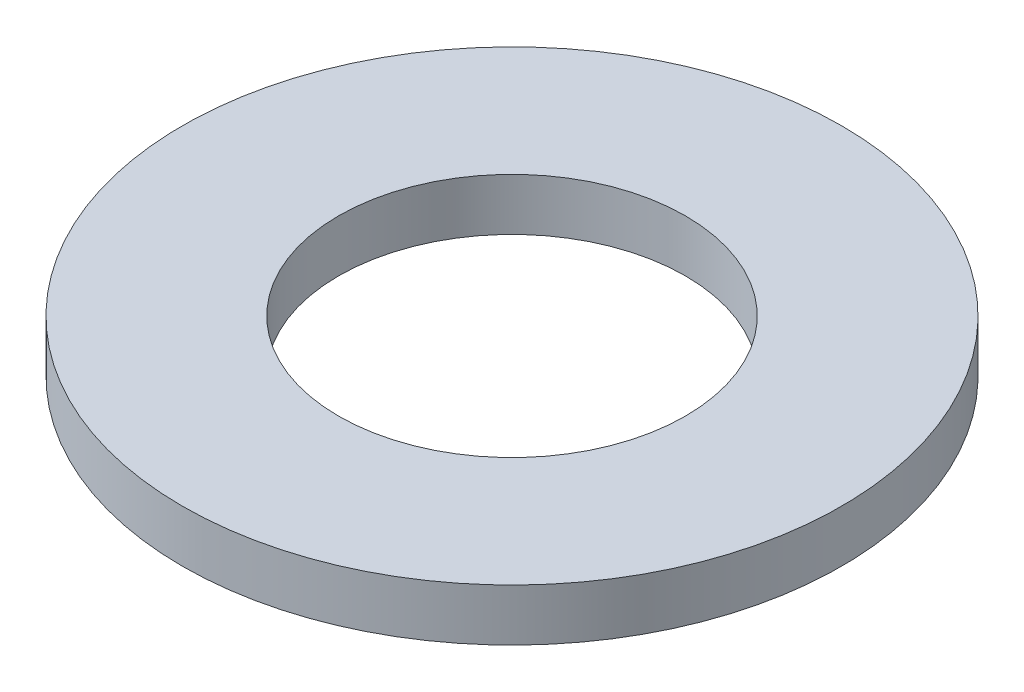
ISO-10303-21;
HEADER;
FILE_DESCRIPTION(('STEP AP214'),'2;1');
FILE_NAME('part.step','',(''),(''),'','','');
FILE_SCHEMA(('AUTOMOTIVE_DESIGN { 1 0 10303 214 1 1 1 1 }'));
ENDSEC;
DATA;
#1=APPLICATION_CONTEXT('core data for automotive mechanical design processes');
#2=APPLICATION_PROTOCOL_DEFINITION('international standard','automotive_design',2000,#1);
#3=PRODUCT_CONTEXT('',#1,'mechanical');
#4=PRODUCT('Part','Part','',(#3));
#5=PRODUCT_RELATED_PRODUCT_CATEGORY('part','',(#4));
#6=PRODUCT_DEFINITION_FORMATION('','',#4);
#7=PRODUCT_DEFINITION_CONTEXT('part definition',#1,'design');
#8=PRODUCT_DEFINITION('design','',#6,#7);
#9=PRODUCT_DEFINITION_SHAPE('','',#8);
#10=(LENGTH_UNIT() NAMED_UNIT(*) SI_UNIT(.MILLI.,.METRE.));
#11=(NAMED_UNIT(*) PLANE_ANGLE_UNIT() SI_UNIT($,.RADIAN.));
#12=(NAMED_UNIT(*) SI_UNIT($,.STERADIAN.) SOLID_ANGLE_UNIT());
#13=UNCERTAINTY_MEASURE_WITH_UNIT(LENGTH_MEASURE(1.E-05),#10,'distance_accuracy_value','');
#14=(GEOMETRIC_REPRESENTATION_CONTEXT(3) GLOBAL_UNCERTAINTY_ASSIGNED_CONTEXT((#13)) GLOBAL_UNIT_ASSIGNED_CONTEXT((#10,
#11,#12)) REPRESENTATION_CONTEXT('',''));
#15=CARTESIAN_POINT('',(0.,0.,0.));
#16=DIRECTION('',(0.,0.,1.));
#17=DIRECTION('',(1.,0.,0.));
#18=AXIS2_PLACEMENT_3D('',#15,#16,#17);
#19=CARTESIAN_POINT('',(0.,15.,0.));
#20=DIRECTION('',(0.,-1.,0.));
#21=DIRECTION('',(0.,0.,-1.));
#22=AXIS2_PLACEMENT_3D('',#19,#20,#21);
#23=CYLINDRICAL_SURFACE('',#22,95.);
#24=CARTESIAN_POINT('',(0.,15.,0.));
#25=DIRECTION('',(0.,1.,0.));
#26=DIRECTION('',(0.,0.,1.));
#27=AXIS2_PLACEMENT_3D('',#24,#25,#26);
#28=CIRCLE('',#27,95.);
#29=CARTESIAN_POINT('',(0.,15.,95.));
#30=VERTEX_POINT('',#29);
#31=EDGE_CURVE('E10',#30,#30,#28,.T.);
#32=ORIENTED_EDGE('',*,*,#31,.F.);
#33=EDGE_LOOP('',(#32));
#34=FACE_BOUND('',#33,.T.);
#35=CARTESIAN_POINT('',(0.,0.,0.));
#36=DIRECTION('',(0.,1.,0.));
#37=DIRECTION('',(0.,0.,1.));
#38=AXIS2_PLACEMENT_3D('',#35,#36,#37);
#39=CIRCLE('',#38,95.);
#40=CARTESIAN_POINT('',(0.,0.,95.));
#41=VERTEX_POINT('',#40);
#42=EDGE_CURVE('E37',#41,#41,#39,.T.);
#43=ORIENTED_EDGE('',*,*,#42,.T.);
#44=EDGE_LOOP('',(#43));
#45=FACE_BOUND('',#44,.T.);
#46=ADVANCED_FACE('F40',(#34,#45),#23,.T.);
#47=CARTESIAN_POINT('',(0.,15.,0.));
#48=DIRECTION('',(0.,1.,0.));
#49=DIRECTION('',(0.,0.,1.));
#50=AXIS2_PLACEMENT_3D('',#47,#48,#49);
#51=PLANE('',#50);
#52=CARTESIAN_POINT('',(0.,15.,0.));
#53=DIRECTION('',(0.,1.,0.));
#54=DIRECTION('',(0.,0.,1.));
#55=AXIS2_PLACEMENT_3D('',#52,#53,#54);
#56=CIRCLE('',#55,50.);
#57=CARTESIAN_POINT('',(0.,15.,50.));
#58=VERTEX_POINT('',#57);
#59=EDGE_CURVE('E50',#58,#58,#56,.T.);
#60=ORIENTED_EDGE('',*,*,#59,.F.);
#61=EDGE_LOOP('',(#60));
#62=FACE_BOUND('',#61,.T.);
#63=ORIENTED_EDGE('',*,*,#31,.T.);
#64=EDGE_LOOP('',(#63));
#65=FACE_BOUND('',#64,.T.);
#66=ADVANCED_FACE('F59',(#62,#65),#51,.T.);
#67=CARTESIAN_POINT('',(0.,0.,0.));
#68=DIRECTION('',(0.,1.,0.));
#69=DIRECTION('',(0.,0.,1.));
#70=AXIS2_PLACEMENT_3D('',#67,#68,#69);
#71=PLANE('',#70);
#72=CARTESIAN_POINT('',(0.,0.,0.));
#73=DIRECTION('',(0.,1.,0.));
#74=DIRECTION('',(0.,0.,1.));
#75=AXIS2_PLACEMENT_3D('',#72,#73,#74);
#76=CIRCLE('',#75,50.);
#77=CARTESIAN_POINT('',(0.,0.,50.));
#78=VERTEX_POINT('',#77);
#79=EDGE_CURVE('E47',#78,#78,#76,.T.);
#80=ORIENTED_EDGE('',*,*,#79,.T.);
#81=EDGE_LOOP('',(#80));
#82=FACE_BOUND('',#81,.T.);
#83=ORIENTED_EDGE('',*,*,#42,.F.);
#84=EDGE_LOOP('',(#83));
#85=FACE_BOUND('',#84,.T.);
#86=ADVANCED_FACE('F58',(#82,#85),#71,.F.);
#87=CARTESIAN_POINT('',(0.,15.,0.));
#88=DIRECTION('',(0.,-1.,0.));
#89=DIRECTION('',(0.,0.,-1.));
#90=AXIS2_PLACEMENT_3D('',#87,#88,#89);
#91=CYLINDRICAL_SURFACE('',#90,50.);
#92=ORIENTED_EDGE('',*,*,#59,.T.);
#93=EDGE_LOOP('',(#92));
#94=FACE_BOUND('',#93,.T.);
#95=ORIENTED_EDGE('',*,*,#79,.F.);
#96=EDGE_LOOP('',(#95));
#97=FACE_BOUND('',#96,.T.);
#98=ADVANCED_FACE('F54',(#94,#97),#91,.F.);
#99=CLOSED_SHELL('',(#46,#66,#86,#98));
#100=MANIFOLD_SOLID_BREP('B2',#99);
#101=ADVANCED_BREP_SHAPE_REPRESENTATION('',(#18,#100),#14);
#102=SHAPE_DEFINITION_REPRESENTATION(#9,#101);
ENDSEC;
END-ISO-10303-21;
